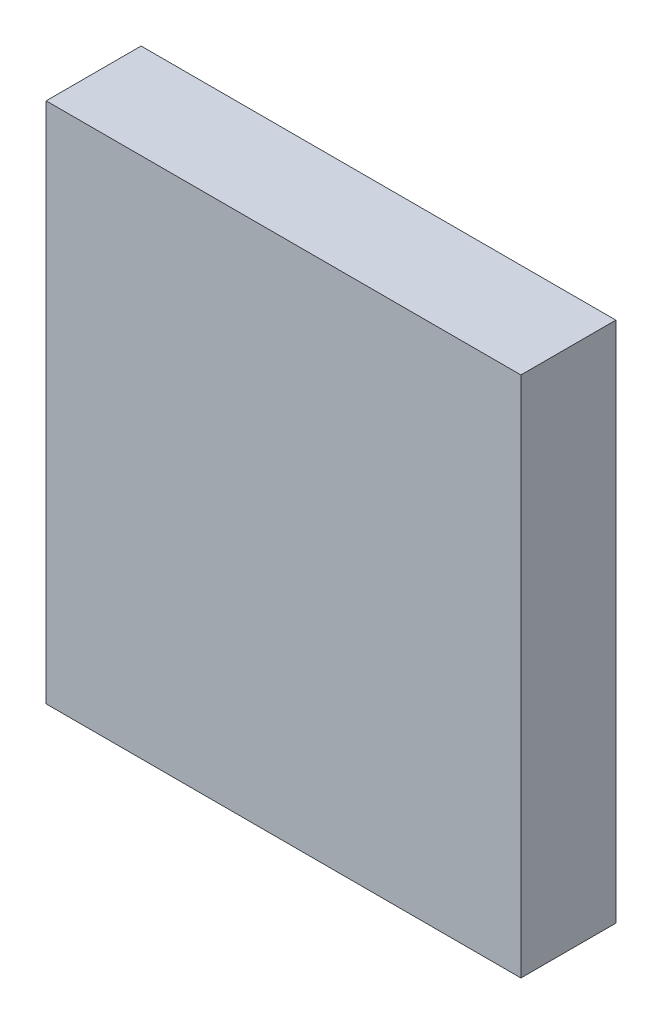
ISO-10303-21;
HEADER;
FILE_DESCRIPTION(('STEP AP214'),'2;1');
FILE_NAME('part.step','',(''),(''),'','','');
FILE_SCHEMA(('AUTOMOTIVE_DESIGN { 1 0 10303 214 1 1 1 1 }'));
ENDSEC;
DATA;
#1=APPLICATION_CONTEXT('core data for automotive mechanical design processes');
#2=APPLICATION_PROTOCOL_DEFINITION('international standard','automotive_design',2000,#1);
#3=PRODUCT_CONTEXT('',#1,'mechanical');
#4=PRODUCT('Part','Part','',(#3));
#5=PRODUCT_RELATED_PRODUCT_CATEGORY('part','',(#4));
#6=PRODUCT_DEFINITION_FORMATION('','',#4);
#7=PRODUCT_DEFINITION_CONTEXT('part definition',#1,'design');
#8=PRODUCT_DEFINITION('design','',#6,#7);
#9=PRODUCT_DEFINITION_SHAPE('','',#8);
#10=(LENGTH_UNIT() NAMED_UNIT(*) SI_UNIT(.MILLI.,.METRE.));
#11=(NAMED_UNIT(*) PLANE_ANGLE_UNIT() SI_UNIT($,.RADIAN.));
#12=(NAMED_UNIT(*) SI_UNIT($,.STERADIAN.) SOLID_ANGLE_UNIT());
#13=UNCERTAINTY_MEASURE_WITH_UNIT(LENGTH_MEASURE(1.E-05),#10,'distance_accuracy_value','');
#14=(GEOMETRIC_REPRESENTATION_CONTEXT(3) GLOBAL_UNCERTAINTY_ASSIGNED_CONTEXT((#13)) GLOBAL_UNIT_ASSIGNED_CONTEXT((#10,
#11,#12)) REPRESENTATION_CONTEXT('',''));
#15=CARTESIAN_POINT('',(0.,0.,0.));
#16=DIRECTION('',(0.,0.,1.));
#17=DIRECTION('',(1.,0.,0.));
#18=AXIS2_PLACEMENT_3D('',#15,#16,#17);
#19=CARTESIAN_POINT('',(-12.5,13.75,5.));
#20=DIRECTION('',(1.,0.,0.));
#21=DIRECTION('',(0.,1.,0.));
#22=AXIS2_PLACEMENT_3D('',#19,#20,#21);
#23=PLANE('',#22);
#24=DIRECTION('',(0.,-1.,0.));
#25=VECTOR('',#24,1.);
#26=CARTESIAN_POINT('',(-12.5,13.75,0.));
#27=LINE('',#26,#25);
#28=CARTESIAN_POINT('',(-12.5,13.75,0.));
#29=VERTEX_POINT('',#28);
#30=CARTESIAN_POINT('',(-12.5,-13.75,0.));
#31=VERTEX_POINT('',#30);
#32=EDGE_CURVE('E95',#29,#31,#27,.T.);
#33=ORIENTED_EDGE('',*,*,#32,.T.);
#34=DIRECTION('',(0.,0.,-1.));
#35=VECTOR('',#34,1.);
#36=CARTESIAN_POINT('',(-12.5,-13.75,5.));
#37=LINE('',#36,#35);
#38=CARTESIAN_POINT('',(-12.5,-13.75,5.));
#39=VERTEX_POINT('',#38);
#40=EDGE_CURVE('E11',#39,#31,#37,.T.);
#41=ORIENTED_EDGE('',*,*,#40,.F.);
#42=DIRECTION('',(0.,-1.,0.));
#43=VECTOR('',#42,1.);
#44=CARTESIAN_POINT('',(-12.5,13.75,5.));
#45=LINE('',#44,#43);
#46=CARTESIAN_POINT('',(-12.5,13.75,5.));
#47=VERTEX_POINT('',#46);
#48=EDGE_CURVE('E83',#47,#39,#45,.T.);
#49=ORIENTED_EDGE('',*,*,#48,.F.);
#50=DIRECTION('',(0.,0.,-1.));
#51=VECTOR('',#50,1.);
#52=CARTESIAN_POINT('',(-12.5,13.75,5.));
#53=LINE('',#52,#51);
#54=EDGE_CURVE('E91',#47,#29,#53,.T.);
#55=ORIENTED_EDGE('',*,*,#54,.T.);
#56=EDGE_LOOP('',(#33,#41,#49,#55));
#57=FACE_BOUND('',#56,.T.);
#58=ADVANCED_FACE('F32',(#57),#23,.F.);
#59=CARTESIAN_POINT('',(-12.5,-13.75,5.));
#60=DIRECTION('',(0.,1.,0.));
#61=DIRECTION('',(0.,0.,1.));
#62=AXIS2_PLACEMENT_3D('',#59,#60,#61);
#63=PLANE('',#62);
#64=DIRECTION('',(1.,0.,0.));
#65=VECTOR('',#64,1.);
#66=CARTESIAN_POINT('',(-12.5,-13.75,0.));
#67=LINE('',#66,#65);
#68=CARTESIAN_POINT('',(12.5,-13.75,0.));
#69=VERTEX_POINT('',#68);
#70=EDGE_CURVE('E87',#31,#69,#67,.T.);
#71=ORIENTED_EDGE('',*,*,#70,.T.);
#72=DIRECTION('',(0.,0.,-1.));
#73=VECTOR('',#72,1.);
#74=CARTESIAN_POINT('',(12.5,-13.75,5.));
#75=LINE('',#74,#73);
#76=CARTESIAN_POINT('',(12.5,-13.75,5.));
#77=VERTEX_POINT('',#76);
#78=EDGE_CURVE('E40',#77,#69,#75,.T.);
#79=ORIENTED_EDGE('',*,*,#78,.F.);
#80=DIRECTION('',(1.,0.,0.));
#81=VECTOR('',#80,1.);
#82=CARTESIAN_POINT('',(-12.5,-13.75,5.));
#83=LINE('',#82,#81);
#84=EDGE_CURVE('E78',#39,#77,#83,.T.);
#85=ORIENTED_EDGE('',*,*,#84,.F.);
#86=ORIENTED_EDGE('',*,*,#40,.T.);
#87=EDGE_LOOP('',(#71,#79,#85,#86));
#88=FACE_BOUND('',#87,.T.);
#89=ADVANCED_FACE('F86',(#88),#63,.F.);
#90=CARTESIAN_POINT('',(12.5,13.75,5.));
#91=DIRECTION('',(-1.,0.,0.));
#92=DIRECTION('',(0.,-1.,0.));
#93=AXIS2_PLACEMENT_3D('',#90,#91,#92);
#94=PLANE('',#93);
#95=DIRECTION('',(0.,1.,0.));
#96=VECTOR('',#95,1.);
#97=CARTESIAN_POINT('',(12.5,13.75,0.));
#98=LINE('',#97,#96);
#99=CARTESIAN_POINT('',(12.5,13.75,0.));
#100=VERTEX_POINT('',#99);
#101=EDGE_CURVE('E65',#69,#100,#98,.T.);
#102=ORIENTED_EDGE('',*,*,#101,.T.);
#103=DIRECTION('',(0.,0.,-1.));
#104=VECTOR('',#103,1.);
#105=CARTESIAN_POINT('',(12.5,13.75,5.));
#106=LINE('',#105,#104);
#107=CARTESIAN_POINT('',(12.5,13.75,5.));
#108=VERTEX_POINT('',#107);
#109=EDGE_CURVE('E88',#108,#100,#106,.T.);
#110=ORIENTED_EDGE('',*,*,#109,.F.);
#111=DIRECTION('',(0.,1.,0.));
#112=VECTOR('',#111,1.);
#113=CARTESIAN_POINT('',(12.5,13.75,5.));
#114=LINE('',#113,#112);
#115=EDGE_CURVE('E81',#77,#108,#114,.T.);
#116=ORIENTED_EDGE('',*,*,#115,.F.);
#117=ORIENTED_EDGE('',*,*,#78,.T.);
#118=EDGE_LOOP('',(#102,#110,#116,#117));
#119=FACE_BOUND('',#118,.T.);
#120=ADVANCED_FACE('F89',(#119),#94,.F.);
#121=CARTESIAN_POINT('',(-12.5,13.75,5.));
#122=DIRECTION('',(0.,-1.,0.));
#123=DIRECTION('',(0.,0.,-1.));
#124=AXIS2_PLACEMENT_3D('',#121,#122,#123);
#125=PLANE('',#124);
#126=DIRECTION('',(-1.,0.,0.));
#127=VECTOR('',#126,1.);
#128=CARTESIAN_POINT('',(-12.5,13.75,0.));
#129=LINE('',#128,#127);
#130=EDGE_CURVE('E71',#100,#29,#129,.T.);
#131=ORIENTED_EDGE('',*,*,#130,.T.);
#132=ORIENTED_EDGE('',*,*,#54,.F.);
#133=DIRECTION('',(-1.,0.,0.));
#134=VECTOR('',#133,1.);
#135=CARTESIAN_POINT('',(-12.5,13.75,5.));
#136=LINE('',#135,#134);
#137=EDGE_CURVE('E48',#108,#47,#136,.T.);
#138=ORIENTED_EDGE('',*,*,#137,.F.);
#139=ORIENTED_EDGE('',*,*,#109,.T.);
#140=EDGE_LOOP('',(#131,#132,#138,#139));
#141=FACE_BOUND('',#140,.T.);
#142=ADVANCED_FACE('F102',(#141),#125,.F.);
#143=CARTESIAN_POINT('',(0.,0.,5.));
#144=DIRECTION('',(0.,0.,1.));
#145=DIRECTION('',(1.,0.,0.));
#146=AXIS2_PLACEMENT_3D('',#143,#144,#145);
#147=PLANE('',#146);
#148=ORIENTED_EDGE('',*,*,#48,.T.);
#149=ORIENTED_EDGE('',*,*,#84,.T.);
#150=ORIENTED_EDGE('',*,*,#115,.T.);
#151=ORIENTED_EDGE('',*,*,#137,.T.);
#152=EDGE_LOOP('',(#148,#149,#150,#151));
#153=FACE_BOUND('',#152,.T.);
#154=ADVANCED_FACE('F79',(#153),#147,.T.);
#155=CARTESIAN_POINT('',(0.,0.,0.));
#156=DIRECTION('',(0.,0.,1.));
#157=DIRECTION('',(1.,0.,0.));
#158=AXIS2_PLACEMENT_3D('',#155,#156,#157);
#159=PLANE('',#158);
#160=ORIENTED_EDGE('',*,*,#32,.F.);
#161=ORIENTED_EDGE('',*,*,#130,.F.);
#162=ORIENTED_EDGE('',*,*,#101,.F.);
#163=ORIENTED_EDGE('',*,*,#70,.F.);
#164=EDGE_LOOP('',(#160,#161,#162,#163));
#165=FACE_BOUND('',#164,.T.);
#166=ADVANCED_FACE('F105',(#165),#159,.F.);
#167=CLOSED_SHELL('',(#58,#89,#120,#142,#154,#166));
#168=MANIFOLD_SOLID_BREP('B2',#167);
#169=ADVANCED_BREP_SHAPE_REPRESENTATION('',(#18,#168),#14);
#170=SHAPE_DEFINITION_REPRESENTATION(#9,#169);
ENDSEC;
END-ISO-10303-21;
